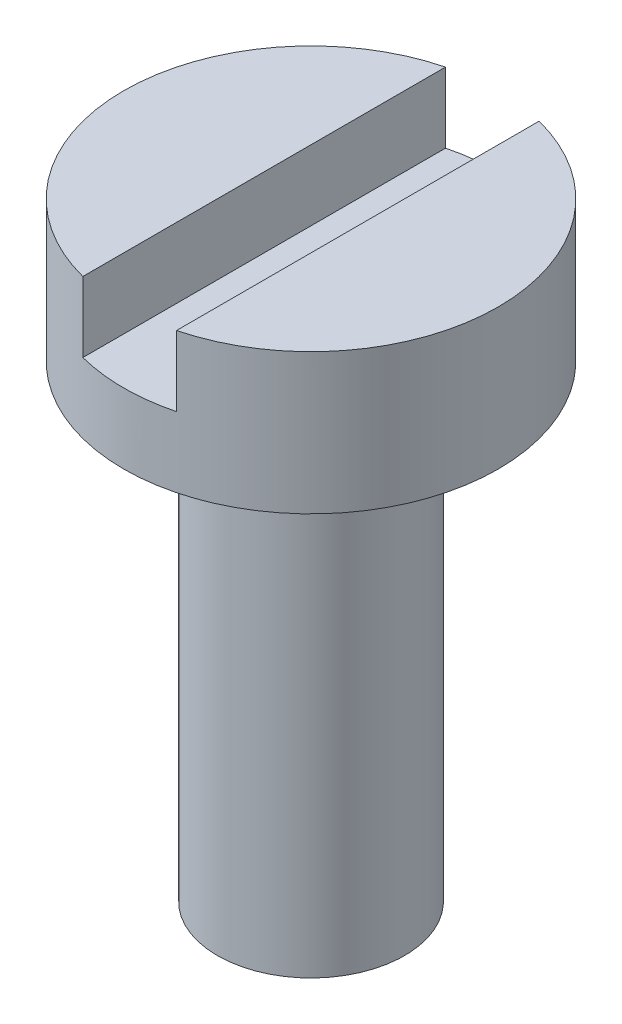
ISO-10303-21;
HEADER;
FILE_DESCRIPTION(('STEP AP214'),'2;1');
FILE_NAME('part.step','',(''),(''),'','','');
FILE_SCHEMA(('AUTOMOTIVE_DESIGN { 1 0 10303 214 1 1 1 1 }'));
ENDSEC;
DATA;
#1=APPLICATION_CONTEXT('core data for automotive mechanical design processes');
#2=APPLICATION_PROTOCOL_DEFINITION('international standard','automotive_design',2000,#1);
#3=PRODUCT_CONTEXT('',#1,'mechanical');
#4=PRODUCT('Part','Part','',(#3));
#5=PRODUCT_RELATED_PRODUCT_CATEGORY('part','',(#4));
#6=PRODUCT_DEFINITION_FORMATION('','',#4);
#7=PRODUCT_DEFINITION_CONTEXT('part definition',#1,'design');
#8=PRODUCT_DEFINITION('design','',#6,#7);
#9=PRODUCT_DEFINITION_SHAPE('','',#8);
#10=(LENGTH_UNIT() NAMED_UNIT(*) SI_UNIT(.MILLI.,.METRE.));
#11=(NAMED_UNIT(*) PLANE_ANGLE_UNIT() SI_UNIT($,.RADIAN.));
#12=(NAMED_UNIT(*) SI_UNIT($,.STERADIAN.) SOLID_ANGLE_UNIT());
#13=UNCERTAINTY_MEASURE_WITH_UNIT(LENGTH_MEASURE(1.E-05),#10,'distance_accuracy_value','');
#14=(GEOMETRIC_REPRESENTATION_CONTEXT(3) GLOBAL_UNCERTAINTY_ASSIGNED_CONTEXT((#13)) GLOBAL_UNIT_ASSIGNED_CONTEXT((#10,
#11,#12)) REPRESENTATION_CONTEXT('',''));
#15=CARTESIAN_POINT('',(0.,0.,0.));
#16=DIRECTION('',(0.,0.,1.));
#17=DIRECTION('',(1.,0.,0.));
#18=AXIS2_PLACEMENT_3D('',#15,#16,#17);
#19=CARTESIAN_POINT('',(0.,3.,0.));
#20=DIRECTION('',(0.,1.,0.));
#21=DIRECTION('',(0.,0.,1.));
#22=AXIS2_PLACEMENT_3D('',#19,#20,#21);
#23=PLANE('',#22);
#24=DIRECTION('',(0.,0.,-1.));
#25=VECTOR('',#24,1.);
#26=CARTESIAN_POINT('',(1.,3.,0.));
#27=LINE('',#26,#25);
#28=CARTESIAN_POINT('',(1.,3.,3.87298334620742));
#29=VERTEX_POINT('',#28);
#30=CARTESIAN_POINT('',(1.,3.,-3.87298334620742));
#31=VERTEX_POINT('',#30);
#32=EDGE_CURVE('E83',#29,#31,#27,.T.);
#33=ORIENTED_EDGE('',*,*,#32,.F.);
#34=CARTESIAN_POINT('',(0.,3.,0.));
#35=DIRECTION('',(0.,1.,0.));
#36=DIRECTION('',(0.,0.,1.));
#37=AXIS2_PLACEMENT_3D('',#34,#35,#36);
#38=CIRCLE('',#37,4.);
#39=EDGE_CURVE('E84',#29,#31,#38,.T.);
#40=ORIENTED_EDGE('',*,*,#39,.T.);
#41=EDGE_LOOP('',(#33,#40));
#42=FACE_BOUND('',#41,.T.);
#43=ADVANCED_FACE('F35',(#42),#23,.T.);
#44=CARTESIAN_POINT('',(0.,3.,0.));
#45=DIRECTION('',(0.,-1.,0.));
#46=DIRECTION('',(0.,0.,-1.));
#47=AXIS2_PLACEMENT_3D('',#44,#45,#46);
#48=CYLINDRICAL_SURFACE('',#47,4.);
#49=CARTESIAN_POINT('',(0.,1.5,0.));
#50=DIRECTION('',(0.,1.,0.));
#51=DIRECTION('',(0.,0.,1.));
#52=AXIS2_PLACEMENT_3D('',#49,#50,#51);
#53=CIRCLE('',#52,4.);
#54=CARTESIAN_POINT('',(1.,1.5,-3.87298334620742));
#55=VERTEX_POINT('',#54);
#56=CARTESIAN_POINT('',(-1.,1.5,-3.87298334620742));
#57=VERTEX_POINT('',#56);
#58=EDGE_CURVE('E43',#55,#57,#53,.T.);
#59=ORIENTED_EDGE('',*,*,#58,.F.);
#60=DIRECTION('',(0.,-1.,0.));
#61=VECTOR('',#60,1.);
#62=CARTESIAN_POINT('',(1.,3.,-3.87298334620742));
#63=LINE('',#62,#61);
#64=EDGE_CURVE('E58',#55,#31,#63,.F.);
#65=ORIENTED_EDGE('',*,*,#64,.T.);
#66=ORIENTED_EDGE('',*,*,#39,.F.);
#67=DIRECTION('',(0.,-1.,0.));
#68=VECTOR('',#67,1.);
#69=CARTESIAN_POINT('',(1.,3.,3.87298334620742));
#70=LINE('',#69,#68);
#71=CARTESIAN_POINT('',(1.,1.5,3.87298334620742));
#72=VERTEX_POINT('',#71);
#73=EDGE_CURVE('E100',#29,#72,#70,.T.);
#74=ORIENTED_EDGE('',*,*,#73,.T.);
#75=CARTESIAN_POINT('',(-1.,1.5,3.87298334620742));
#76=VERTEX_POINT('',#75);
#77=EDGE_CURVE('E92',#76,#72,#53,.T.);
#78=ORIENTED_EDGE('',*,*,#77,.F.);
#79=DIRECTION('',(0.,-1.,0.));
#80=VECTOR('',#79,1.);
#81=CARTESIAN_POINT('',(-1.,3.,3.87298334620742));
#82=LINE('',#81,#80);
#83=CARTESIAN_POINT('',(-1.,3.,3.87298334620742));
#84=VERTEX_POINT('',#83);
#85=EDGE_CURVE('E78',#76,#84,#82,.F.);
#86=ORIENTED_EDGE('',*,*,#85,.T.);
#87=CARTESIAN_POINT('',(-1.,3.,-3.87298334620742));
#88=VERTEX_POINT('',#87);
#89=EDGE_CURVE('E90',#88,#84,#38,.T.);
#90=ORIENTED_EDGE('',*,*,#89,.F.);
#91=DIRECTION('',(0.,-1.,0.));
#92=VECTOR('',#91,1.);
#93=CARTESIAN_POINT('',(-1.,3.,-3.87298334620742));
#94=LINE('',#93,#92);
#95=EDGE_CURVE('E50',#88,#57,#94,.T.);
#96=ORIENTED_EDGE('',*,*,#95,.T.);
#97=EDGE_LOOP('',(#59,#65,#66,#74,#78,#86,#90,#96));
#98=FACE_BOUND('',#97,.T.);
#99=CARTESIAN_POINT('',(0.,0.,0.));
#100=DIRECTION('',(0.,1.,0.));
#101=DIRECTION('',(0.,0.,1.));
#102=AXIS2_PLACEMENT_3D('',#99,#100,#101);
#103=CIRCLE('',#102,4.);
#104=CARTESIAN_POINT('',(0.,0.,4.));
#105=VERTEX_POINT('',#104);
#106=EDGE_CURVE('E96',#105,#105,#103,.T.);
#107=ORIENTED_EDGE('',*,*,#106,.T.);
#108=EDGE_LOOP('',(#107));
#109=FACE_BOUND('',#108,.T.);
#110=ADVANCED_FACE('F37',(#98,#109),#48,.T.);
#111=DIRECTION('',(0.,0.,1.));
#112=VECTOR('',#111,1.);
#113=CARTESIAN_POINT('',(-1.,3.,0.));
#114=LINE('',#113,#112);
#115=EDGE_CURVE('E75',#88,#84,#114,.T.);
#116=ORIENTED_EDGE('',*,*,#115,.F.);
#117=ORIENTED_EDGE('',*,*,#89,.T.);
#118=EDGE_LOOP('',(#116,#117));
#119=FACE_BOUND('',#118,.T.);
#120=ADVANCED_FACE('F95',(#119),#23,.T.);
#121=CARTESIAN_POINT('',(0.,0.,0.));
#122=DIRECTION('',(0.,1.,0.));
#123=DIRECTION('',(0.,0.,1.));
#124=AXIS2_PLACEMENT_3D('',#121,#122,#123);
#125=PLANE('',#124);
#126=CARTESIAN_POINT('',(0.,0.,0.));
#127=DIRECTION('',(0.,1.,0.));
#128=DIRECTION('',(0.,0.,1.));
#129=AXIS2_PLACEMENT_3D('',#126,#127,#128);
#130=CIRCLE('',#129,2.);
#131=CARTESIAN_POINT('',(0.,0.,2.));
#132=VERTEX_POINT('',#131);
#133=EDGE_CURVE('E11',#132,#132,#130,.F.);
#134=ORIENTED_EDGE('',*,*,#133,.F.);
#135=EDGE_LOOP('',(#134));
#136=FACE_BOUND('',#135,.T.);
#137=ORIENTED_EDGE('',*,*,#106,.F.);
#138=EDGE_LOOP('',(#137));
#139=FACE_BOUND('',#138,.T.);
#140=ADVANCED_FACE('F122',(#136,#139),#125,.F.);
#141=CARTESIAN_POINT('',(-1.,1.5,-5.0783360345759));
#142=DIRECTION('',(0.,1.,0.));
#143=DIRECTION('',(0.,0.,1.));
#144=AXIS2_PLACEMENT_3D('',#141,#142,#143);
#145=PLANE('',#144);
#146=ORIENTED_EDGE('',*,*,#58,.T.);
#147=DIRECTION('',(0.,0.,1.));
#148=VECTOR('',#147,1.);
#149=CARTESIAN_POINT('',(-1.,1.5,-5.0783360345759));
#150=LINE('',#149,#148);
#151=EDGE_CURVE('E106',#57,#76,#150,.T.);
#152=ORIENTED_EDGE('',*,*,#151,.T.);
#153=ORIENTED_EDGE('',*,*,#77,.T.);
#154=DIRECTION('',(0.,0.,-1.));
#155=VECTOR('',#154,1.);
#156=CARTESIAN_POINT('',(1.,1.5,4.40122456329912));
#157=LINE('',#156,#155);
#158=EDGE_CURVE('E93',#72,#55,#157,.T.);
#159=ORIENTED_EDGE('',*,*,#158,.T.);
#160=EDGE_LOOP('',(#146,#152,#153,#159));
#161=FACE_BOUND('',#160,.T.);
#162=ADVANCED_FACE('F105',(#161),#145,.T.);
#163=CARTESIAN_POINT('',(1.,1.5,4.40122456329912));
#164=DIRECTION('',(1.,0.,0.));
#165=DIRECTION('',(0.,0.,-1.));
#166=AXIS2_PLACEMENT_3D('',#163,#164,#165);
#167=PLANE('',#166);
#168=ORIENTED_EDGE('',*,*,#32,.T.);
#169=ORIENTED_EDGE('',*,*,#64,.F.);
#170=ORIENTED_EDGE('',*,*,#158,.F.);
#171=ORIENTED_EDGE('',*,*,#73,.F.);
#172=EDGE_LOOP('',(#168,#169,#170,#171));
#173=FACE_BOUND('',#172,.T.);
#174=ADVANCED_FACE('F114',(#173),#167,.F.);
#175=CARTESIAN_POINT('',(-1.,1.5,-5.0783360345759));
#176=DIRECTION('',(-1.,0.,0.));
#177=DIRECTION('',(0.,0.,1.));
#178=AXIS2_PLACEMENT_3D('',#175,#176,#177);
#179=PLANE('',#178);
#180=ORIENTED_EDGE('',*,*,#115,.T.);
#181=ORIENTED_EDGE('',*,*,#85,.F.);
#182=ORIENTED_EDGE('',*,*,#151,.F.);
#183=ORIENTED_EDGE('',*,*,#95,.F.);
#184=EDGE_LOOP('',(#180,#181,#182,#183));
#185=FACE_BOUND('',#184,.T.);
#186=ADVANCED_FACE('F77',(#185),#179,.F.);
#187=CARTESIAN_POINT('',(0.,-10.,0.));
#188=DIRECTION('',(0.,1.,0.));
#189=DIRECTION('',(0.,0.,1.));
#190=AXIS2_PLACEMENT_3D('',#187,#188,#189);
#191=CYLINDRICAL_SURFACE('',#190,2.);
#192=CARTESIAN_POINT('',(0.,-10.,0.));
#193=DIRECTION('',(0.,-1.,0.));
#194=DIRECTION('',(0.,0.,-1.));
#195=AXIS2_PLACEMENT_3D('',#192,#193,#194);
#196=CIRCLE('',#195,2.);
#197=CARTESIAN_POINT('',(0.,-10.,-2.));
#198=VERTEX_POINT('',#197);
#199=EDGE_CURVE('E107',#198,#198,#196,.T.);
#200=ORIENTED_EDGE('',*,*,#199,.F.);
#201=EDGE_LOOP('',(#200));
#202=FACE_BOUND('',#201,.T.);
#203=ORIENTED_EDGE('',*,*,#133,.T.);
#204=EDGE_LOOP('',(#203));
#205=FACE_BOUND('',#204,.T.);
#206=ADVANCED_FACE('F136',(#202,#205),#191,.T.);
#207=CARTESIAN_POINT('',(0.,-10.,0.));
#208=DIRECTION('',(0.,-1.,0.));
#209=DIRECTION('',(0.,0.,-1.));
#210=AXIS2_PLACEMENT_3D('',#207,#208,#209);
#211=PLANE('',#210);
#212=ORIENTED_EDGE('',*,*,#199,.T.);
#213=EDGE_LOOP('',(#212));
#214=FACE_BOUND('',#213,.T.);
#215=ADVANCED_FACE('F141',(#214),#211,.T.);
#216=CLOSED_SHELL('',(#43,#110,#120,#140,#162,#174,#186,#206,#215));
#217=MANIFOLD_SOLID_BREP('B2',#216);
#218=ADVANCED_BREP_SHAPE_REPRESENTATION('',(#18,#217),#14);
#219=SHAPE_DEFINITION_REPRESENTATION(#9,#218);
ENDSEC;
END-ISO-10303-21;
